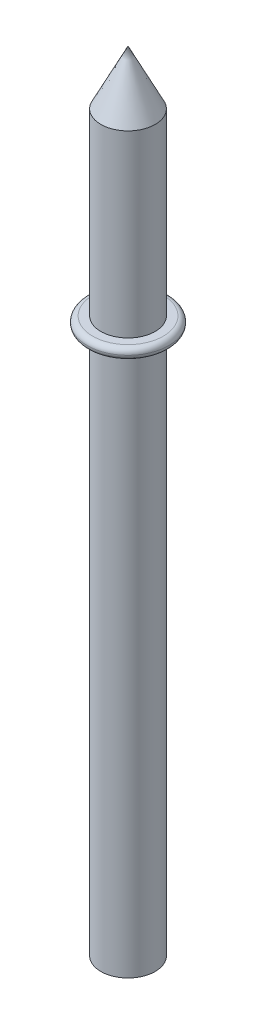
ISO-10303-21;
HEADER;
FILE_DESCRIPTION(('STEP AP214'),'2;1');
FILE_NAME('part.step','',(''),(''),'','','');
FILE_SCHEMA(('AUTOMOTIVE_DESIGN { 1 0 10303 214 1 1 1 1 }'));
ENDSEC;
DATA;
#1=APPLICATION_CONTEXT('core data for automotive mechanical design processes');
#2=APPLICATION_PROTOCOL_DEFINITION('international standard','automotive_design',2000,#1);
#3=PRODUCT_CONTEXT('',#1,'mechanical');
#4=PRODUCT('Part','Part','',(#3));
#5=PRODUCT_RELATED_PRODUCT_CATEGORY('part','',(#4));
#6=PRODUCT_DEFINITION_FORMATION('','',#4);
#7=PRODUCT_DEFINITION_CONTEXT('part definition',#1,'design');
#8=PRODUCT_DEFINITION('design','',#6,#7);
#9=PRODUCT_DEFINITION_SHAPE('','',#8);
#10=(LENGTH_UNIT() NAMED_UNIT(*) SI_UNIT(.MILLI.,.METRE.));
#11=(NAMED_UNIT(*) PLANE_ANGLE_UNIT() SI_UNIT($,.RADIAN.));
#12=(NAMED_UNIT(*) SI_UNIT($,.STERADIAN.) SOLID_ANGLE_UNIT());
#13=UNCERTAINTY_MEASURE_WITH_UNIT(LENGTH_MEASURE(1.E-05),#10,'distance_accuracy_value','');
#14=(GEOMETRIC_REPRESENTATION_CONTEXT(3) GLOBAL_UNCERTAINTY_ASSIGNED_CONTEXT((#13)) GLOBAL_UNIT_ASSIGNED_CONTEXT((#10,
#11,#12)) REPRESENTATION_CONTEXT('',''));
#15=CARTESIAN_POINT('',(0.,0.,0.));
#16=DIRECTION('',(0.,0.,1.));
#17=DIRECTION('',(1.,0.,0.));
#18=AXIS2_PLACEMENT_3D('',#15,#16,#17);
#19=CARTESIAN_POINT('',(0.,135.,0.));
#20=DIRECTION('',(0.,-1.,0.));
#21=DIRECTION('',(0.,0.,-1.));
#22=AXIS2_PLACEMENT_3D('',#19,#20,#21);
#23=CYLINDRICAL_SURFACE('',#22,5.);
#24=CARTESIAN_POINT('',(0.,135.,0.));
#25=DIRECTION('',(0.,1.,0.));
#26=DIRECTION('',(0.,0.,1.));
#27=AXIS2_PLACEMENT_3D('',#24,#25,#26);
#28=CIRCLE('',#27,5.);
#29=CARTESIAN_POINT('',(0.,135.,5.));
#30=VERTEX_POINT('',#29);
#31=EDGE_CURVE('E64',#30,#30,#28,.T.);
#32=ORIENTED_EDGE('',*,*,#31,.F.);
#33=EDGE_LOOP('',(#32));
#34=FACE_BOUND('',#33,.T.);
#35=CARTESIAN_POINT('',(0.,102.,0.));
#36=DIRECTION('',(0.,-1.,0.));
#37=DIRECTION('',(0.,0.,-1.));
#38=AXIS2_PLACEMENT_3D('',#35,#36,#37);
#39=CIRCLE('',#38,5.);
#40=CARTESIAN_POINT('',(0.,102.,-5.));
#41=VERTEX_POINT('',#40);
#42=EDGE_CURVE('E67',#41,#41,#39,.T.);
#43=ORIENTED_EDGE('',*,*,#42,.F.);
#44=EDGE_LOOP('',(#43));
#45=FACE_BOUND('',#44,.T.);
#46=ADVANCED_FACE('F45',(#34,#45),#23,.T.);
#47=CARTESIAN_POINT('',(0.,135.,0.));
#48=DIRECTION('',(0.,-1.,0.));
#49=DIRECTION('',(0.,0.,-1.));
#50=AXIS2_PLACEMENT_3D('',#47,#48,#49);
#51=CONICAL_SURFACE('',#50,5.,0.463647609000806);
#52=CARTESIAN_POINT('',(0.,145.,0.));
#53=VERTEX_POINT('',#52);
#54=VERTEX_LOOP('',#53);
#55=FACE_BOUND('',#54,.T.);
#56=ORIENTED_EDGE('',*,*,#31,.T.);
#57=EDGE_LOOP('',(#56));
#58=FACE_BOUND('',#57,.T.);
#59=ADVANCED_FACE('F57',(#55,#58),#51,.T.);
#60=CARTESIAN_POINT('',(0.,102.,0.));
#61=DIRECTION('',(0.,-1.,0.));
#62=DIRECTION('',(0.,0.,-1.));
#63=AXIS2_PLACEMENT_3D('',#60,#61,#62);
#64=PLANE('',#63);
#65=CARTESIAN_POINT('',(0.,102.,0.));
#66=DIRECTION('',(0.,-1.,0.));
#67=DIRECTION('',(0.,0.,-1.));
#68=AXIS2_PLACEMENT_3D('',#65,#66,#67);
#69=CIRCLE('',#68,6.5);
#70=CARTESIAN_POINT('',(0.,102.,-6.5));
#71=VERTEX_POINT('',#70);
#72=EDGE_CURVE('E11',#71,#71,#69,.F.);
#73=ORIENTED_EDGE('',*,*,#72,.T.);
#74=EDGE_LOOP('',(#73));
#75=FACE_BOUND('',#74,.T.);
#76=ORIENTED_EDGE('',*,*,#42,.T.);
#77=EDGE_LOOP('',(#76));
#78=FACE_BOUND('',#77,.T.);
#79=ADVANCED_FACE('F60',(#75,#78),#64,.F.);
#80=CARTESIAN_POINT('',(0.,100.,0.));
#81=DIRECTION('',(0.,-1.,0.));
#82=DIRECTION('',(0.,0.,-1.));
#83=AXIS2_PLACEMENT_3D('',#80,#81,#82);
#84=PLANE('',#83);
#85=CARTESIAN_POINT('',(0.,100.,0.));
#86=DIRECTION('',(0.,-1.,0.));
#87=DIRECTION('',(0.,0.,-1.));
#88=AXIS2_PLACEMENT_3D('',#85,#86,#87);
#89=CIRCLE('',#88,6.5);
#90=CARTESIAN_POINT('',(0.,100.,-6.5));
#91=VERTEX_POINT('',#90);
#92=EDGE_CURVE('E54',#91,#91,#89,.T.);
#93=ORIENTED_EDGE('',*,*,#92,.T.);
#94=EDGE_LOOP('',(#93));
#95=FACE_BOUND('',#94,.T.);
#96=CARTESIAN_POINT('',(0.,100.,0.));
#97=DIRECTION('',(0.,-1.,0.));
#98=DIRECTION('',(0.,0.,-1.));
#99=AXIS2_PLACEMENT_3D('',#96,#97,#98);
#100=CIRCLE('',#99,5.);
#101=CARTESIAN_POINT('',(0.,100.,-5.));
#102=VERTEX_POINT('',#101);
#103=EDGE_CURVE('E75',#102,#102,#100,.T.);
#104=ORIENTED_EDGE('',*,*,#103,.F.);
#105=EDGE_LOOP('',(#104));
#106=FACE_BOUND('',#105,.T.);
#107=ADVANCED_FACE('F83',(#95,#106),#84,.T.);
#108=CARTESIAN_POINT('',(0.,0.,0.));
#109=DIRECTION('',(0.,1.,0.));
#110=DIRECTION('',(0.,0.,1.));
#111=AXIS2_PLACEMENT_3D('',#108,#109,#110);
#112=PLANE('',#111);
#113=CARTESIAN_POINT('',(0.,0.,0.));
#114=DIRECTION('',(0.,1.,0.));
#115=DIRECTION('',(0.,0.,1.));
#116=AXIS2_PLACEMENT_3D('',#113,#114,#115);
#117=CIRCLE('',#116,5.);
#118=CARTESIAN_POINT('',(0.,0.,5.));
#119=VERTEX_POINT('',#118);
#120=EDGE_CURVE('E68',#119,#119,#117,.T.);
#121=ORIENTED_EDGE('',*,*,#120,.F.);
#122=EDGE_LOOP('',(#121));
#123=FACE_BOUND('',#122,.T.);
#124=ADVANCED_FACE('F102',(#123),#112,.F.);
#125=ORIENTED_EDGE('',*,*,#103,.T.);
#126=EDGE_LOOP('',(#125));
#127=FACE_BOUND('',#126,.T.);
#128=ORIENTED_EDGE('',*,*,#120,.T.);
#129=EDGE_LOOP('',(#128));
#130=FACE_BOUND('',#129,.T.);
#131=ADVANCED_FACE('F92',(#127,#130),#23,.T.);
#132=CARTESIAN_POINT('',(0.,101.,0.));
#133=DIRECTION('',(0.,-1.,0.));
#134=DIRECTION('',(0.,0.,-1.));
#135=AXIS2_PLACEMENT_3D('',#132,#133,#134);
#136=TOROIDAL_SURFACE('',#135,6.5,1.);
#137=ORIENTED_EDGE('',*,*,#72,.F.);
#138=EDGE_LOOP('',(#137));
#139=FACE_BOUND('',#138,.T.);
#140=CARTESIAN_POINT('',(0.,101.,0.));
#141=DIRECTION('',(0.,-1.,0.));
#142=DIRECTION('',(0.,0.,-1.));
#143=AXIS2_PLACEMENT_3D('',#140,#141,#142);
#144=CIRCLE('',#143,7.5);
#145=CARTESIAN_POINT('',(0.,101.,-7.5));
#146=VERTEX_POINT('',#145);
#147=EDGE_CURVE('E49',#146,#146,#144,.T.);
#148=ORIENTED_EDGE('',*,*,#147,.F.);
#149=EDGE_LOOP('',(#148));
#150=FACE_BOUND('',#149,.T.);
#151=ADVANCED_FACE('F47',(#139,#150),#136,.T.);
#152=CARTESIAN_POINT('',(0.,101.,0.));
#153=DIRECTION('',(0.,-1.,0.));
#154=DIRECTION('',(0.,0.,-1.));
#155=AXIS2_PLACEMENT_3D('',#152,#153,#154);
#156=TOROIDAL_SURFACE('',#155,6.5,1.);
#157=ORIENTED_EDGE('',*,*,#147,.T.);
#158=EDGE_LOOP('',(#157));
#159=FACE_BOUND('',#158,.T.);
#160=ORIENTED_EDGE('',*,*,#92,.F.);
#161=EDGE_LOOP('',(#160));
#162=FACE_BOUND('',#161,.T.);
#163=ADVANCED_FACE('F86',(#159,#162),#156,.T.);
#164=CLOSED_SHELL('',(#46,#59,#79,#107,#124,#131,#151,#163));
#165=MANIFOLD_SOLID_BREP('B2',#164);
#166=ADVANCED_BREP_SHAPE_REPRESENTATION('',(#18,#165),#14);
#167=SHAPE_DEFINITION_REPRESENTATION(#9,#166);
ENDSEC;
END-ISO-10303-21;
